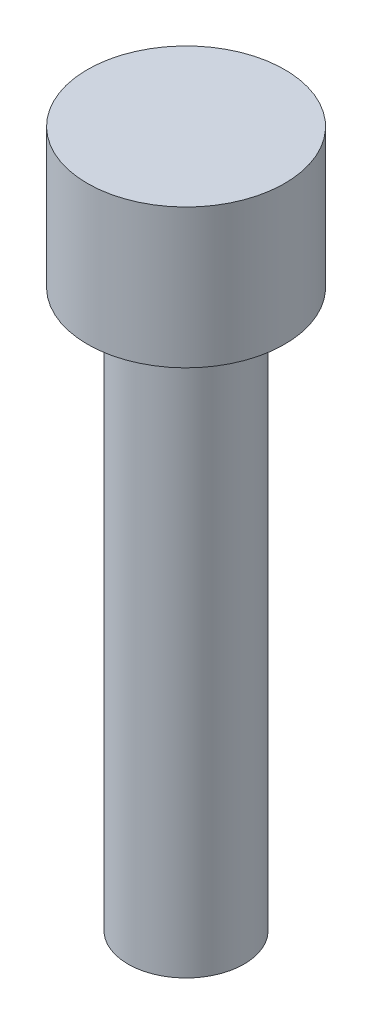
ISO-10303-21;
HEADER;
FILE_DESCRIPTION(('STEP AP214'),'2;1');
FILE_NAME('part.step','',(''),(''),'','','');
FILE_SCHEMA(('AUTOMOTIVE_DESIGN { 1 0 10303 214 1 1 1 1 }'));
ENDSEC;
DATA;
#1=APPLICATION_CONTEXT('core data for automotive mechanical design processes');
#2=APPLICATION_PROTOCOL_DEFINITION('international standard','automotive_design',2000,#1);
#3=PRODUCT_CONTEXT('',#1,'mechanical');
#4=PRODUCT('Part','Part','',(#3));
#5=PRODUCT_RELATED_PRODUCT_CATEGORY('part','',(#4));
#6=PRODUCT_DEFINITION_FORMATION('','',#4);
#7=PRODUCT_DEFINITION_CONTEXT('part definition',#1,'design');
#8=PRODUCT_DEFINITION('design','',#6,#7);
#9=PRODUCT_DEFINITION_SHAPE('','',#8);
#10=(LENGTH_UNIT() NAMED_UNIT(*) SI_UNIT(.MILLI.,.METRE.));
#11=(NAMED_UNIT(*) PLANE_ANGLE_UNIT() SI_UNIT($,.RADIAN.));
#12=(NAMED_UNIT(*) SI_UNIT($,.STERADIAN.) SOLID_ANGLE_UNIT());
#13=UNCERTAINTY_MEASURE_WITH_UNIT(LENGTH_MEASURE(1.E-05),#10,'distance_accuracy_value','');
#14=(GEOMETRIC_REPRESENTATION_CONTEXT(3) GLOBAL_UNCERTAINTY_ASSIGNED_CONTEXT((#13)) GLOBAL_UNIT_ASSIGNED_CONTEXT((#10,
#11,#12)) REPRESENTATION_CONTEXT('',''));
#15=CARTESIAN_POINT('',(0.,0.,0.));
#16=DIRECTION('',(0.,0.,1.));
#17=DIRECTION('',(1.,0.,0.));
#18=AXIS2_PLACEMENT_3D('',#15,#16,#17);
#19=CARTESIAN_POINT('',(0.,24.,0.));
#20=DIRECTION('',(0.,-1.,0.));
#21=DIRECTION('',(0.,0.,-1.));
#22=AXIS2_PLACEMENT_3D('',#19,#20,#21);
#23=CYLINDRICAL_SURFACE('',#22,2.5);
#24=CARTESIAN_POINT('',(0.,24.,0.));
#25=DIRECTION('',(0.,1.,0.));
#26=DIRECTION('',(0.,0.,1.));
#27=AXIS2_PLACEMENT_3D('',#24,#25,#26);
#28=CIRCLE('',#27,2.5);
#29=CARTESIAN_POINT('',(0.,24.,2.5));
#30=VERTEX_POINT('',#29);
#31=EDGE_CURVE('E10',#30,#30,#28,.T.);
#32=ORIENTED_EDGE('',*,*,#31,.F.);
#33=EDGE_LOOP('',(#32));
#34=FACE_BOUND('',#33,.T.);
#35=CARTESIAN_POINT('',(0.,0.,0.));
#36=DIRECTION('',(0.,1.,0.));
#37=DIRECTION('',(0.,0.,1.));
#38=AXIS2_PLACEMENT_3D('',#35,#36,#37);
#39=CIRCLE('',#38,2.5);
#40=CARTESIAN_POINT('',(0.,0.,2.5));
#41=VERTEX_POINT('',#40);
#42=EDGE_CURVE('E44',#41,#41,#39,.T.);
#43=ORIENTED_EDGE('',*,*,#42,.T.);
#44=EDGE_LOOP('',(#43));
#45=FACE_BOUND('',#44,.T.);
#46=ADVANCED_FACE('F41',(#34,#45),#23,.T.);
#47=CARTESIAN_POINT('',(0.,0.,0.));
#48=DIRECTION('',(0.,1.,0.));
#49=DIRECTION('',(0.,0.,1.));
#50=AXIS2_PLACEMENT_3D('',#47,#48,#49);
#51=PLANE('',#50);
#52=ORIENTED_EDGE('',*,*,#42,.F.);
#53=EDGE_LOOP('',(#52));
#54=FACE_BOUND('',#53,.T.);
#55=ADVANCED_FACE('F64',(#54),#51,.F.);
#56=CARTESIAN_POINT('',(0.,30.,0.));
#57=DIRECTION('',(0.,-1.,0.));
#58=DIRECTION('',(0.,0.,-1.));
#59=AXIS2_PLACEMENT_3D('',#56,#57,#58);
#60=CYLINDRICAL_SURFACE('',#59,4.25);
#61=CARTESIAN_POINT('',(0.,30.,0.));
#62=DIRECTION('',(0.,1.,0.));
#63=DIRECTION('',(0.,0.,1.));
#64=AXIS2_PLACEMENT_3D('',#61,#62,#63);
#65=CIRCLE('',#64,4.25);
#66=CARTESIAN_POINT('',(0.,30.,4.25));
#67=VERTEX_POINT('',#66);
#68=EDGE_CURVE('E51',#67,#67,#65,.T.);
#69=ORIENTED_EDGE('',*,*,#68,.F.);
#70=EDGE_LOOP('',(#69));
#71=FACE_BOUND('',#70,.T.);
#72=CARTESIAN_POINT('',(0.,24.,0.));
#73=DIRECTION('',(0.,1.,0.));
#74=DIRECTION('',(0.,0.,1.));
#75=AXIS2_PLACEMENT_3D('',#72,#73,#74);
#76=CIRCLE('',#75,4.25);
#77=CARTESIAN_POINT('',(0.,24.,4.25));
#78=VERTEX_POINT('',#77);
#79=EDGE_CURVE('E53',#78,#78,#76,.T.);
#80=ORIENTED_EDGE('',*,*,#79,.T.);
#81=EDGE_LOOP('',(#80));
#82=FACE_BOUND('',#81,.T.);
#83=ADVANCED_FACE('F61',(#71,#82),#60,.T.);
#84=CARTESIAN_POINT('',(0.,30.,0.));
#85=DIRECTION('',(0.,1.,0.));
#86=DIRECTION('',(0.,0.,1.));
#87=AXIS2_PLACEMENT_3D('',#84,#85,#86);
#88=PLANE('',#87);
#89=ORIENTED_EDGE('',*,*,#68,.T.);
#90=EDGE_LOOP('',(#89));
#91=FACE_BOUND('',#90,.T.);
#92=ADVANCED_FACE('F59',(#91),#88,.T.);
#93=CARTESIAN_POINT('',(0.,24.,0.));
#94=DIRECTION('',(0.,1.,0.));
#95=DIRECTION('',(0.,0.,1.));
#96=AXIS2_PLACEMENT_3D('',#93,#94,#95);
#97=PLANE('',#96);
#98=ORIENTED_EDGE('',*,*,#31,.T.);
#99=EDGE_LOOP('',(#98));
#100=FACE_BOUND('',#99,.T.);
#101=ORIENTED_EDGE('',*,*,#79,.F.);
#102=EDGE_LOOP('',(#101));
#103=FACE_BOUND('',#102,.T.);
#104=ADVANCED_FACE('F68',(#100,#103),#97,.F.);
#105=CLOSED_SHELL('',(#46,#55,#83,#92,#104));
#106=MANIFOLD_SOLID_BREP('B2',#105);
#107=ADVANCED_BREP_SHAPE_REPRESENTATION('',(#18,#106),#14);
#108=SHAPE_DEFINITION_REPRESENTATION(#9,#107);
ENDSEC;
END-ISO-10303-21;
